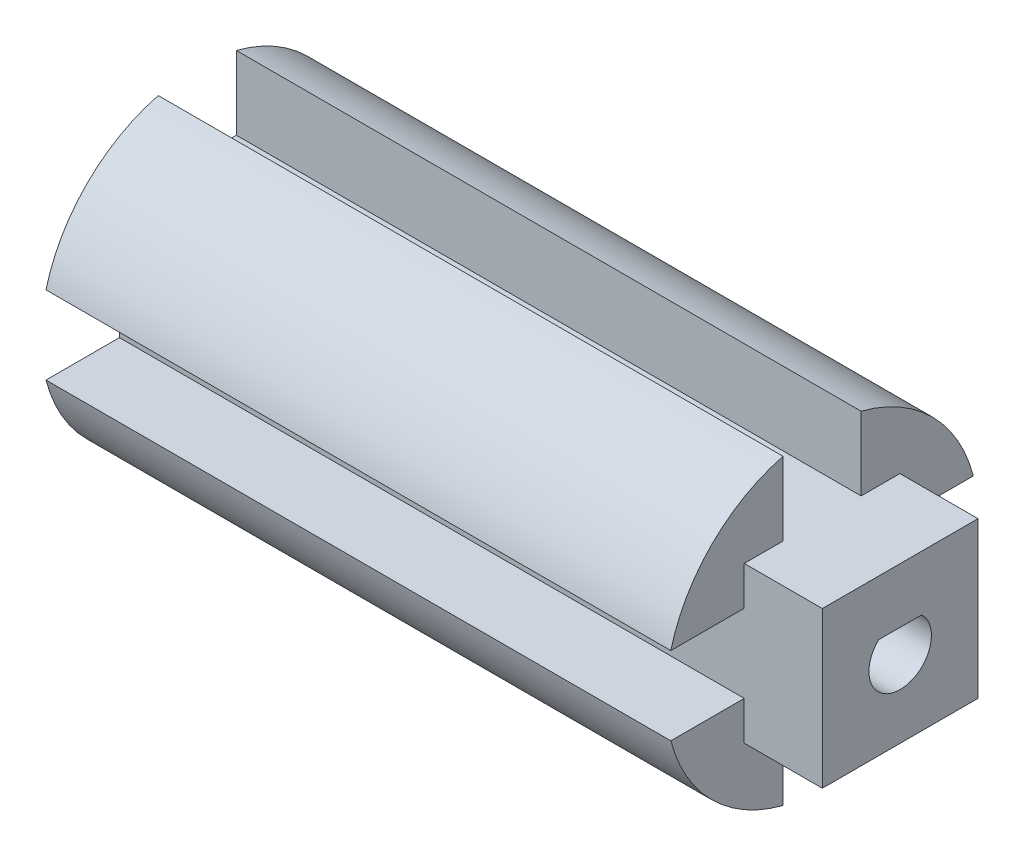
ISO-10303-21;
HEADER;
FILE_DESCRIPTION(('STEP AP214'),'2;1');
FILE_NAME('part.step','',(''),(''),'','','');
FILE_SCHEMA(('AUTOMOTIVE_DESIGN { 1 0 10303 214 1 1 1 1 }'));
ENDSEC;
DATA;
#1=APPLICATION_CONTEXT('core data for automotive mechanical design processes');
#2=APPLICATION_PROTOCOL_DEFINITION('international standard','automotive_design',2000,#1);
#3=PRODUCT_CONTEXT('',#1,'mechanical');
#4=PRODUCT('Part','Part','',(#3));
#5=PRODUCT_RELATED_PRODUCT_CATEGORY('part','',(#4));
#6=PRODUCT_DEFINITION_FORMATION('','',#4);
#7=PRODUCT_DEFINITION_CONTEXT('part definition',#1,'design');
#8=PRODUCT_DEFINITION('design','',#6,#7);
#9=PRODUCT_DEFINITION_SHAPE('','',#8);
#10=(LENGTH_UNIT() NAMED_UNIT(*) SI_UNIT(.MILLI.,.METRE.));
#11=(NAMED_UNIT(*) PLANE_ANGLE_UNIT() SI_UNIT($,.RADIAN.));
#12=(NAMED_UNIT(*) SI_UNIT($,.STERADIAN.) SOLID_ANGLE_UNIT());
#13=UNCERTAINTY_MEASURE_WITH_UNIT(LENGTH_MEASURE(1.E-05),#10,'distance_accuracy_value','');
#14=(GEOMETRIC_REPRESENTATION_CONTEXT(3) GLOBAL_UNCERTAINTY_ASSIGNED_CONTEXT((#13)) GLOBAL_UNIT_ASSIGNED_CONTEXT((#10,
#11,#12)) REPRESENTATION_CONTEXT('',''));
#15=CARTESIAN_POINT('',(0.,0.,0.));
#16=DIRECTION('',(0.,0.,1.));
#17=DIRECTION('',(1.,0.,0.));
#18=AXIS2_PLACEMENT_3D('',#15,#16,#17);
#19=CARTESIAN_POINT('',(90.,5.,0.));
#20=DIRECTION('',(0.,1.,0.));
#21=DIRECTION('',(0.,0.,1.));
#22=AXIS2_PLACEMENT_3D('',#19,#20,#21);
#23=PLANE('',#22);
#24=DIRECTION('',(0.,0.,-1.));
#25=VECTOR('',#24,1.);
#26=CARTESIAN_POINT('',(80.,5.,0.));
#27=LINE('',#26,#25);
#28=CARTESIAN_POINT('',(80.,5.,-9.96491673103709));
#29=VERTEX_POINT('',#28);
#30=CARTESIAN_POINT('',(80.,5.,-19.3649167310371));
#31=VERTEX_POINT('',#30);
#32=EDGE_CURVE('E201',#29,#31,#27,.T.);
#33=ORIENTED_EDGE('',*,*,#32,.F.);
#34=DIRECTION('',(-1.,0.,0.));
#35=VECTOR('',#34,1.);
#36=CARTESIAN_POINT('',(90.,5.,-9.96491673103709));
#37=LINE('',#36,#35);
#38=CARTESIAN_POINT('',(0.,5.,-9.96491673103709));
#39=VERTEX_POINT('',#38);
#40=EDGE_CURVE('E196',#29,#39,#37,.T.);
#41=ORIENTED_EDGE('',*,*,#40,.T.);
#42=DIRECTION('',(0.,0.,-1.));
#43=VECTOR('',#42,1.);
#44=CARTESIAN_POINT('',(0.,5.,0.));
#45=LINE('',#44,#43);
#46=CARTESIAN_POINT('',(0.,5.,-19.3649167310371));
#47=VERTEX_POINT('',#46);
#48=EDGE_CURVE('E304',#39,#47,#45,.T.);
#49=ORIENTED_EDGE('',*,*,#48,.T.);
#50=DIRECTION('',(-1.,0.,0.));
#51=VECTOR('',#50,1.);
#52=CARTESIAN_POINT('',(90.,5.,-19.3649167310371));
#53=LINE('',#52,#51);
#54=EDGE_CURVE('E11',#31,#47,#53,.T.);
#55=ORIENTED_EDGE('',*,*,#54,.F.);
#56=EDGE_LOOP('',(#33,#41,#49,#55));
#57=FACE_BOUND('',#56,.T.);
#58=ADVANCED_FACE('F42',(#57),#23,.F.);
#59=CARTESIAN_POINT('',(90.,0.,0.));
#60=DIRECTION('',(-1.,0.,0.));
#61=DIRECTION('',(0.,0.,1.));
#62=AXIS2_PLACEMENT_3D('',#59,#60,#61);
#63=CYLINDRICAL_SURFACE('',#62,20.);
#64=CARTESIAN_POINT('',(80.,0.,0.));
#65=DIRECTION('',(1.,0.,0.));
#66=DIRECTION('',(0.,0.,-1.));
#67=AXIS2_PLACEMENT_3D('',#64,#65,#66);
#68=CIRCLE('',#67,20.);
#69=CARTESIAN_POINT('',(80.,19.3649167310371,-5.));
#70=VERTEX_POINT('',#69);
#71=EDGE_CURVE('E227',#31,#70,#68,.T.);
#72=ORIENTED_EDGE('',*,*,#71,.F.);
#73=ORIENTED_EDGE('',*,*,#54,.T.);
#74=CARTESIAN_POINT('',(0.,0.,0.));
#75=DIRECTION('',(1.,0.,0.));
#76=DIRECTION('',(0.,0.,-1.));
#77=AXIS2_PLACEMENT_3D('',#74,#75,#76);
#78=CIRCLE('',#77,20.);
#79=CARTESIAN_POINT('',(0.,19.3649167310371,-5.));
#80=VERTEX_POINT('',#79);
#81=EDGE_CURVE('E321',#47,#80,#78,.T.);
#82=ORIENTED_EDGE('',*,*,#81,.T.);
#83=DIRECTION('',(-1.,0.,0.));
#84=VECTOR('',#83,1.);
#85=CARTESIAN_POINT('',(90.,19.3649167310371,-5.));
#86=LINE('',#85,#84);
#87=EDGE_CURVE('E50',#70,#80,#86,.T.);
#88=ORIENTED_EDGE('',*,*,#87,.F.);
#89=EDGE_LOOP('',(#72,#73,#82,#88));
#90=FACE_BOUND('',#89,.T.);
#91=ADVANCED_FACE('F419',(#90),#63,.T.);
#92=CARTESIAN_POINT('',(90.,0.,-5.));
#93=DIRECTION('',(0.,0.,1.));
#94=DIRECTION('',(0.,-1.,0.));
#95=AXIS2_PLACEMENT_3D('',#92,#93,#94);
#96=PLANE('',#95);
#97=DIRECTION('',(-1.,0.,0.));
#98=VECTOR('',#97,1.);
#99=CARTESIAN_POINT('',(90.,9.96491673103709,-5.));
#100=LINE('',#99,#98);
#101=CARTESIAN_POINT('',(80.,9.96491673103709,-5.));
#102=VERTEX_POINT('',#101);
#103=CARTESIAN_POINT('',(0.,9.96491673103709,-5.));
#104=VERTEX_POINT('',#103);
#105=EDGE_CURVE('E409',#102,#104,#100,.T.);
#106=ORIENTED_EDGE('',*,*,#105,.F.);
#107=DIRECTION('',(0.,-1.,0.));
#108=VECTOR('',#107,1.);
#109=CARTESIAN_POINT('',(80.,0.,-5.));
#110=LINE('',#109,#108);
#111=EDGE_CURVE('E213',#70,#102,#110,.T.);
#112=ORIENTED_EDGE('',*,*,#111,.F.);
#113=ORIENTED_EDGE('',*,*,#87,.T.);
#114=DIRECTION('',(0.,1.,0.));
#115=VECTOR('',#114,1.);
#116=CARTESIAN_POINT('',(0.,0.,-5.));
#117=LINE('',#116,#115);
#118=EDGE_CURVE('E325',#104,#80,#117,.T.);
#119=ORIENTED_EDGE('',*,*,#118,.F.);
#120=EDGE_LOOP('',(#106,#112,#113,#119));
#121=FACE_BOUND('',#120,.T.);
#122=ADVANCED_FACE('F415',(#121),#96,.T.);
#123=CARTESIAN_POINT('',(90.,0.,5.));
#124=DIRECTION('',(0.,0.,1.));
#125=DIRECTION('',(0.,-1.,0.));
#126=AXIS2_PLACEMENT_3D('',#123,#124,#125);
#127=PLANE('',#126);
#128=DIRECTION('',(0.,1.,0.));
#129=VECTOR('',#128,1.);
#130=CARTESIAN_POINT('',(80.,0.,5.));
#131=LINE('',#130,#129);
#132=CARTESIAN_POINT('',(80.,9.96491673103709,5.));
#133=VERTEX_POINT('',#132);
#134=CARTESIAN_POINT('',(80.,19.3649167310371,5.));
#135=VERTEX_POINT('',#134);
#136=EDGE_CURVE('E272',#133,#135,#131,.T.);
#137=ORIENTED_EDGE('',*,*,#136,.F.);
#138=DIRECTION('',(-1.,0.,0.));
#139=VECTOR('',#138,1.);
#140=CARTESIAN_POINT('',(90.,9.96491673103709,5.));
#141=LINE('',#140,#139);
#142=CARTESIAN_POINT('',(0.,9.96491673103709,5.));
#143=VERTEX_POINT('',#142);
#144=EDGE_CURVE('E406',#133,#143,#141,.T.);
#145=ORIENTED_EDGE('',*,*,#144,.T.);
#146=DIRECTION('',(0.,1.,0.));
#147=VECTOR('',#146,1.);
#148=CARTESIAN_POINT('',(0.,0.,5.));
#149=LINE('',#148,#147);
#150=CARTESIAN_POINT('',(0.,19.3649167310371,5.));
#151=VERTEX_POINT('',#150);
#152=EDGE_CURVE('E335',#143,#151,#149,.T.);
#153=ORIENTED_EDGE('',*,*,#152,.T.);
#154=DIRECTION('',(-1.,0.,0.));
#155=VECTOR('',#154,1.);
#156=CARTESIAN_POINT('',(90.,19.3649167310371,5.));
#157=LINE('',#156,#155);
#158=EDGE_CURVE('E403',#135,#151,#157,.T.);
#159=ORIENTED_EDGE('',*,*,#158,.F.);
#160=EDGE_LOOP('',(#137,#145,#153,#159));
#161=FACE_BOUND('',#160,.T.);
#162=ADVANCED_FACE('F430',(#161),#127,.F.);
#163=CARTESIAN_POINT('',(80.,0.,0.));
#164=DIRECTION('',(1.,0.,0.));
#165=DIRECTION('',(0.,0.,-1.));
#166=AXIS2_PLACEMENT_3D('',#163,#164,#165);
#167=CIRCLE('',#166,20.);
#168=CARTESIAN_POINT('',(80.,5.,19.3649167310371));
#169=VERTEX_POINT('',#168);
#170=EDGE_CURVE('E275',#135,#169,#167,.T.);
#171=ORIENTED_EDGE('',*,*,#170,.F.);
#172=ORIENTED_EDGE('',*,*,#158,.T.);
#173=CARTESIAN_POINT('',(0.,5.,19.3649167310371));
#174=VERTEX_POINT('',#173);
#175=EDGE_CURVE('E327',#151,#174,#78,.T.);
#176=ORIENTED_EDGE('',*,*,#175,.T.);
#177=DIRECTION('',(-1.,0.,0.));
#178=VECTOR('',#177,1.);
#179=CARTESIAN_POINT('',(90.,5.,19.3649167310371));
#180=LINE('',#179,#178);
#181=EDGE_CURVE('E400',#169,#174,#180,.T.);
#182=ORIENTED_EDGE('',*,*,#181,.F.);
#183=EDGE_LOOP('',(#171,#172,#176,#182));
#184=FACE_BOUND('',#183,.T.);
#185=ADVANCED_FACE('F439',(#184),#63,.T.);
#186=CARTESIAN_POINT('',(90.,5.,0.));
#187=DIRECTION('',(0.,1.,0.));
#188=DIRECTION('',(0.,0.,1.));
#189=AXIS2_PLACEMENT_3D('',#186,#187,#188);
#190=PLANE('',#189);
#191=DIRECTION('',(0.,0.,-1.));
#192=VECTOR('',#191,1.);
#193=CARTESIAN_POINT('',(80.,5.,0.));
#194=LINE('',#193,#192);
#195=CARTESIAN_POINT('',(80.,5.,9.96491673103709));
#196=VERTEX_POINT('',#195);
#197=EDGE_CURVE('E278',#169,#196,#194,.T.);
#198=ORIENTED_EDGE('',*,*,#197,.F.);
#199=ORIENTED_EDGE('',*,*,#181,.T.);
#200=DIRECTION('',(0.,0.,-1.));
#201=VECTOR('',#200,1.);
#202=CARTESIAN_POINT('',(0.,5.,0.));
#203=LINE('',#202,#201);
#204=CARTESIAN_POINT('',(0.,5.,9.96491673103709));
#205=VERTEX_POINT('',#204);
#206=EDGE_CURVE('E339',#174,#205,#203,.T.);
#207=ORIENTED_EDGE('',*,*,#206,.T.);
#208=DIRECTION('',(-1.,0.,0.));
#209=VECTOR('',#208,1.);
#210=CARTESIAN_POINT('',(90.,5.,9.96491673103709));
#211=LINE('',#210,#209);
#212=EDGE_CURVE('E397',#196,#205,#211,.T.);
#213=ORIENTED_EDGE('',*,*,#212,.F.);
#214=EDGE_LOOP('',(#198,#199,#207,#213));
#215=FACE_BOUND('',#214,.T.);
#216=ADVANCED_FACE('F443',(#215),#190,.F.);
#217=CARTESIAN_POINT('',(90.,-5.,0.));
#218=DIRECTION('',(0.,1.,0.));
#219=DIRECTION('',(0.,0.,1.));
#220=AXIS2_PLACEMENT_3D('',#217,#218,#219);
#221=PLANE('',#220);
#222=DIRECTION('',(-1.,0.,0.));
#223=VECTOR('',#222,1.);
#224=CARTESIAN_POINT('',(90.,-5.,19.3649167310371));
#225=LINE('',#224,#223);
#226=CARTESIAN_POINT('',(80.,-4.99999999999999,19.3649167310371));
#227=VERTEX_POINT('',#226);
#228=CARTESIAN_POINT('',(0.,-5.,19.3649167310371));
#229=VERTEX_POINT('',#228);
#230=EDGE_CURVE('E391',#227,#229,#225,.T.);
#231=ORIENTED_EDGE('',*,*,#230,.F.);
#232=DIRECTION('',(0.,0.,1.));
#233=VECTOR('',#232,1.);
#234=CARTESIAN_POINT('',(80.,-5.,0.));
#235=LINE('',#234,#233);
#236=CARTESIAN_POINT('',(80.,-5.,9.96491673103709));
#237=VERTEX_POINT('',#236);
#238=EDGE_CURVE('E254',#237,#227,#235,.T.);
#239=ORIENTED_EDGE('',*,*,#238,.F.);
#240=DIRECTION('',(-1.,0.,0.));
#241=VECTOR('',#240,1.);
#242=CARTESIAN_POINT('',(90.,-5.,9.96491673103709));
#243=LINE('',#242,#241);
#244=CARTESIAN_POINT('',(0.,-5.,9.96491673103709));
#245=VERTEX_POINT('',#244);
#246=EDGE_CURVE('E394',#237,#245,#243,.T.);
#247=ORIENTED_EDGE('',*,*,#246,.T.);
#248=DIRECTION('',(0.,0.,-1.));
#249=VECTOR('',#248,1.);
#250=CARTESIAN_POINT('',(0.,-5.,0.));
#251=LINE('',#250,#249);
#252=EDGE_CURVE('E347',#229,#245,#251,.T.);
#253=ORIENTED_EDGE('',*,*,#252,.F.);
#254=EDGE_LOOP('',(#231,#239,#247,#253));
#255=FACE_BOUND('',#254,.T.);
#256=ADVANCED_FACE('F488',(#255),#221,.T.);
#257=CARTESIAN_POINT('',(80.,0.,0.));
#258=DIRECTION('',(1.,0.,0.));
#259=DIRECTION('',(0.,0.,-1.));
#260=AXIS2_PLACEMENT_3D('',#257,#258,#259);
#261=CIRCLE('',#260,20.);
#262=CARTESIAN_POINT('',(80.,-19.3649167310371,5.));
#263=VERTEX_POINT('',#262);
#264=EDGE_CURVE('E257',#227,#263,#261,.T.);
#265=ORIENTED_EDGE('',*,*,#264,.F.);
#266=ORIENTED_EDGE('',*,*,#230,.T.);
#267=CARTESIAN_POINT('',(0.,-19.3649167310371,5.));
#268=VERTEX_POINT('',#267);
#269=EDGE_CURVE('E351',#229,#268,#78,.T.);
#270=ORIENTED_EDGE('',*,*,#269,.T.);
#271=DIRECTION('',(-1.,0.,0.));
#272=VECTOR('',#271,1.);
#273=CARTESIAN_POINT('',(90.,-19.3649167310371,5.));
#274=LINE('',#273,#272);
#275=EDGE_CURVE('E388',#263,#268,#274,.T.);
#276=ORIENTED_EDGE('',*,*,#275,.F.);
#277=EDGE_LOOP('',(#265,#266,#270,#276));
#278=FACE_BOUND('',#277,.T.);
#279=ADVANCED_FACE('F477',(#278),#63,.T.);
#280=CARTESIAN_POINT('',(90.,0.,5.));
#281=DIRECTION('',(0.,0.,1.));
#282=DIRECTION('',(0.,-1.,0.));
#283=AXIS2_PLACEMENT_3D('',#280,#281,#282);
#284=PLANE('',#283);
#285=DIRECTION('',(0.,1.,0.));
#286=VECTOR('',#285,1.);
#287=CARTESIAN_POINT('',(80.,0.,5.));
#288=LINE('',#287,#286);
#289=CARTESIAN_POINT('',(80.,-9.96491673103708,5.));
#290=VERTEX_POINT('',#289);
#291=EDGE_CURVE('E260',#263,#290,#288,.T.);
#292=ORIENTED_EDGE('',*,*,#291,.F.);
#293=ORIENTED_EDGE('',*,*,#275,.T.);
#294=DIRECTION('',(0.,1.,0.));
#295=VECTOR('',#294,1.);
#296=CARTESIAN_POINT('',(0.,0.,5.));
#297=LINE('',#296,#295);
#298=CARTESIAN_POINT('',(0.,-9.96491673103708,5.));
#299=VERTEX_POINT('',#298);
#300=EDGE_CURVE('E352',#268,#299,#297,.T.);
#301=ORIENTED_EDGE('',*,*,#300,.T.);
#302=DIRECTION('',(-1.,0.,0.));
#303=VECTOR('',#302,1.);
#304=CARTESIAN_POINT('',(90.,-9.96491673103708,5.));
#305=LINE('',#304,#303);
#306=EDGE_CURVE('E385',#290,#299,#305,.T.);
#307=ORIENTED_EDGE('',*,*,#306,.F.);
#308=EDGE_LOOP('',(#292,#293,#301,#307));
#309=FACE_BOUND('',#308,.T.);
#310=ADVANCED_FACE('F485',(#309),#284,.F.);
#311=CARTESIAN_POINT('',(90.,0.,-5.));
#312=DIRECTION('',(0.,0.,1.));
#313=DIRECTION('',(0.,-1.,0.));
#314=AXIS2_PLACEMENT_3D('',#311,#312,#313);
#315=PLANE('',#314);
#316=DIRECTION('',(-1.,0.,0.));
#317=VECTOR('',#316,1.);
#318=CARTESIAN_POINT('',(90.,-19.3649167310371,-5.));
#319=LINE('',#318,#317);
#320=CARTESIAN_POINT('',(80.,-19.3649167310371,-5.));
#321=VERTEX_POINT('',#320);
#322=CARTESIAN_POINT('',(0.,-19.3649167310371,-5.));
#323=VERTEX_POINT('',#322);
#324=EDGE_CURVE('E379',#321,#323,#319,.T.);
#325=ORIENTED_EDGE('',*,*,#324,.F.);
#326=DIRECTION('',(0.,-1.,0.));
#327=VECTOR('',#326,1.);
#328=CARTESIAN_POINT('',(80.,0.,-5.));
#329=LINE('',#328,#327);
#330=CARTESIAN_POINT('',(80.,-9.96491673103708,-5.));
#331=VERTEX_POINT('',#330);
#332=EDGE_CURVE('E239',#331,#321,#329,.T.);
#333=ORIENTED_EDGE('',*,*,#332,.F.);
#334=DIRECTION('',(-1.,0.,0.));
#335=VECTOR('',#334,1.);
#336=CARTESIAN_POINT('',(90.,-9.96491673103708,-5.));
#337=LINE('',#336,#335);
#338=CARTESIAN_POINT('',(0.,-9.96491673103708,-5.));
#339=VERTEX_POINT('',#338);
#340=EDGE_CURVE('E382',#331,#339,#337,.T.);
#341=ORIENTED_EDGE('',*,*,#340,.T.);
#342=DIRECTION('',(0.,1.,0.));
#343=VECTOR('',#342,1.);
#344=CARTESIAN_POINT('',(0.,0.,-5.));
#345=LINE('',#344,#343);
#346=EDGE_CURVE('E360',#323,#339,#345,.T.);
#347=ORIENTED_EDGE('',*,*,#346,.F.);
#348=EDGE_LOOP('',(#325,#333,#341,#347));
#349=FACE_BOUND('',#348,.T.);
#350=ADVANCED_FACE('F479',(#349),#315,.T.);
#351=CARTESIAN_POINT('',(80.,0.,0.));
#352=DIRECTION('',(1.,0.,0.));
#353=DIRECTION('',(0.,0.,-1.));
#354=AXIS2_PLACEMENT_3D('',#351,#352,#353);
#355=CIRCLE('',#354,20.);
#356=CARTESIAN_POINT('',(80.,-5.,-19.3649167310371));
#357=VERTEX_POINT('',#356);
#358=EDGE_CURVE('E242',#321,#357,#355,.T.);
#359=ORIENTED_EDGE('',*,*,#358,.F.);
#360=ORIENTED_EDGE('',*,*,#324,.T.);
#361=CARTESIAN_POINT('',(0.,-5.,-19.3649167310371));
#362=VERTEX_POINT('',#361);
#363=EDGE_CURVE('E326',#323,#362,#78,.T.);
#364=ORIENTED_EDGE('',*,*,#363,.T.);
#365=DIRECTION('',(-1.,0.,0.));
#366=VECTOR('',#365,1.);
#367=CARTESIAN_POINT('',(90.,-5.,-19.3649167310371));
#368=LINE('',#367,#366);
#369=EDGE_CURVE('E376',#357,#362,#368,.T.);
#370=ORIENTED_EDGE('',*,*,#369,.F.);
#371=EDGE_LOOP('',(#359,#360,#364,#370));
#372=FACE_BOUND('',#371,.T.);
#373=ADVANCED_FACE('F470',(#372),#63,.T.);
#374=CARTESIAN_POINT('',(90.,-5.,0.));
#375=DIRECTION('',(0.,1.,0.));
#376=DIRECTION('',(0.,0.,1.));
#377=AXIS2_PLACEMENT_3D('',#374,#375,#376);
#378=PLANE('',#377);
#379=DIRECTION('',(-1.,0.,0.));
#380=VECTOR('',#379,1.);
#381=CARTESIAN_POINT('',(90.,-5.,-9.96491673103709));
#382=LINE('',#381,#380);
#383=CARTESIAN_POINT('',(80.,-5.,-9.96491673103709));
#384=VERTEX_POINT('',#383);
#385=CARTESIAN_POINT('',(0.,-5.,-9.96491673103709));
#386=VERTEX_POINT('',#385);
#387=EDGE_CURVE('E373',#384,#386,#382,.T.);
#388=ORIENTED_EDGE('',*,*,#387,.F.);
#389=DIRECTION('',(0.,0.,1.));
#390=VECTOR('',#389,1.);
#391=CARTESIAN_POINT('',(80.,-5.,0.));
#392=LINE('',#391,#390);
#393=EDGE_CURVE('E222',#357,#384,#392,.T.);
#394=ORIENTED_EDGE('',*,*,#393,.F.);
#395=ORIENTED_EDGE('',*,*,#369,.T.);
#396=DIRECTION('',(0.,0.,-1.));
#397=VECTOR('',#396,1.);
#398=CARTESIAN_POINT('',(0.,-5.,0.));
#399=LINE('',#398,#397);
#400=EDGE_CURVE('E364',#386,#362,#399,.T.);
#401=ORIENTED_EDGE('',*,*,#400,.F.);
#402=EDGE_LOOP('',(#388,#394,#395,#401));
#403=FACE_BOUND('',#402,.T.);
#404=ADVANCED_FACE('F462',(#403),#378,.T.);
#405=CARTESIAN_POINT('',(90.,0.,0.));
#406=DIRECTION('',(1.,0.,0.));
#407=DIRECTION('',(0.,0.,-1.));
#408=AXIS2_PLACEMENT_3D('',#405,#406,#407);
#409=PLANE('',#408);
#410=CARTESIAN_POINT('',(90.,0.,0.));
#411=DIRECTION('',(1.,0.,0.));
#412=DIRECTION('',(0.,0.,-1.));
#413=AXIS2_PLACEMENT_3D('',#410,#411,#412);
#414=CIRCLE('',#413,4.);
#415=CARTESIAN_POINT('',(90.,2.9,2.75499546279118));
#416=VERTEX_POINT('',#415);
#417=CARTESIAN_POINT('',(90.,2.9,-2.75499546279118));
#418=VERTEX_POINT('',#417);
#419=EDGE_CURVE('E285',#416,#418,#414,.T.);
#420=ORIENTED_EDGE('',*,*,#419,.F.);
#421=DIRECTION('',(0.,0.,1.));
#422=VECTOR('',#421,1.);
#423=CARTESIAN_POINT('',(90.,2.9,2.75499546279118));
#424=LINE('',#423,#422);
#425=EDGE_CURVE('E291',#418,#416,#424,.T.);
#426=ORIENTED_EDGE('',*,*,#425,.F.);
#427=EDGE_LOOP('',(#420,#426));
#428=FACE_BOUND('',#427,.T.);
#429=DIRECTION('',(0.,-1.,0.));
#430=VECTOR('',#429,1.);
#431=CARTESIAN_POINT('',(90.,0.,9.96491673103709));
#432=LINE('',#431,#430);
#433=CARTESIAN_POINT('',(90.,9.96491673103709,9.96491673103709));
#434=VERTEX_POINT('',#433);
#435=CARTESIAN_POINT('',(90.,-9.96491673103708,9.96491673103709));
#436=VERTEX_POINT('',#435);
#437=EDGE_CURVE('E310',#434,#436,#432,.T.);
#438=ORIENTED_EDGE('',*,*,#437,.T.);
#439=DIRECTION('',(0.,0.,-1.));
#440=VECTOR('',#439,1.);
#441=CARTESIAN_POINT('',(90.,-9.96491673103708,0.));
#442=LINE('',#441,#440);
#443=CARTESIAN_POINT('',(90.,-9.96491673103708,-9.96491673103709));
#444=VERTEX_POINT('',#443);
#445=EDGE_CURVE('E57',#436,#444,#442,.T.);
#446=ORIENTED_EDGE('',*,*,#445,.T.);
#447=DIRECTION('',(0.,-1.,0.));
#448=VECTOR('',#447,1.);
#449=CARTESIAN_POINT('',(90.,0.,-9.96491673103709));
#450=LINE('',#449,#448);
#451=CARTESIAN_POINT('',(90.,9.96491673103709,-9.96491673103709));
#452=VERTEX_POINT('',#451);
#453=EDGE_CURVE('E65',#452,#444,#450,.T.);
#454=ORIENTED_EDGE('',*,*,#453,.F.);
#455=DIRECTION('',(0.,0.,-1.));
#456=VECTOR('',#455,1.);
#457=CARTESIAN_POINT('',(90.,9.96491673103709,0.));
#458=LINE('',#457,#456);
#459=EDGE_CURVE('E210',#434,#452,#458,.T.);
#460=ORIENTED_EDGE('',*,*,#459,.F.);
#461=EDGE_LOOP('',(#438,#446,#454,#460));
#462=FACE_BOUND('',#461,.T.);
#463=ADVANCED_FACE('F449',(#428,#462),#409,.T.);
#464=CARTESIAN_POINT('',(90.,9.96491673103709,0.));
#465=DIRECTION('',(0.,1.,0.));
#466=DIRECTION('',(0.,0.,1.));
#467=AXIS2_PLACEMENT_3D('',#464,#465,#466);
#468=PLANE('',#467);
#469=DIRECTION('',(0.,0.,-1.));
#470=VECTOR('',#469,1.);
#471=CARTESIAN_POINT('',(0.,9.96491673103709,0.));
#472=LINE('',#471,#470);
#473=EDGE_CURVE('E331',#143,#104,#472,.T.);
#474=ORIENTED_EDGE('',*,*,#473,.F.);
#475=ORIENTED_EDGE('',*,*,#144,.F.);
#476=DIRECTION('',(0.,0.,1.));
#477=VECTOR('',#476,1.);
#478=CARTESIAN_POINT('',(80.,9.96491673103709,0.));
#479=LINE('',#478,#477);
#480=CARTESIAN_POINT('',(80.,9.96491673103709,9.96491673103709));
#481=VERTEX_POINT('',#480);
#482=EDGE_CURVE('E269',#133,#481,#479,.T.);
#483=ORIENTED_EDGE('',*,*,#482,.T.);
#484=DIRECTION('',(1.,0.,0.));
#485=VECTOR('',#484,1.);
#486=CARTESIAN_POINT('',(80.,9.96491673103709,9.96491673103709));
#487=LINE('',#486,#485);
#488=EDGE_CURVE('E282',#481,#434,#487,.T.);
#489=ORIENTED_EDGE('',*,*,#488,.T.);
#490=ORIENTED_EDGE('',*,*,#459,.T.);
#491=DIRECTION('',(1.,0.,0.));
#492=VECTOR('',#491,1.);
#493=CARTESIAN_POINT('',(80.,9.96491673103709,-9.96491673103709));
#494=LINE('',#493,#492);
#495=CARTESIAN_POINT('',(80.,9.96491673103709,-9.96491673103709));
#496=VERTEX_POINT('',#495);
#497=EDGE_CURVE('E195',#496,#452,#494,.T.);
#498=ORIENTED_EDGE('',*,*,#497,.F.);
#499=DIRECTION('',(0.,0.,1.));
#500=VECTOR('',#499,1.);
#501=CARTESIAN_POINT('',(80.,9.96491673103709,0.));
#502=LINE('',#501,#500);
#503=EDGE_CURVE('E202',#496,#102,#502,.T.);
#504=ORIENTED_EDGE('',*,*,#503,.T.);
#505=ORIENTED_EDGE('',*,*,#105,.T.);
#506=EDGE_LOOP('',(#474,#475,#483,#489,#490,#498,#504,#505));
#507=FACE_BOUND('',#506,.T.);
#508=ADVANCED_FACE('F206',(#507),#468,.T.);
#509=CARTESIAN_POINT('',(90.,0.,9.96491673103709));
#510=DIRECTION('',(0.,0.,-1.));
#511=DIRECTION('',(-1.,0.,0.));
#512=AXIS2_PLACEMENT_3D('',#509,#510,#511);
#513=PLANE('',#512);
#514=DIRECTION('',(0.,-1.,0.));
#515=VECTOR('',#514,1.);
#516=CARTESIAN_POINT('',(0.,0.,9.96491673103709));
#517=LINE('',#516,#515);
#518=EDGE_CURVE('E343',#205,#245,#517,.T.);
#519=ORIENTED_EDGE('',*,*,#518,.T.);
#520=ORIENTED_EDGE('',*,*,#246,.F.);
#521=DIRECTION('',(0.,-1.,0.));
#522=VECTOR('',#521,1.);
#523=CARTESIAN_POINT('',(80.,0.,9.96491673103709));
#524=LINE('',#523,#522);
#525=CARTESIAN_POINT('',(80.,-9.96491673103708,9.96491673103709));
#526=VERTEX_POINT('',#525);
#527=EDGE_CURVE('E251',#237,#526,#524,.T.);
#528=ORIENTED_EDGE('',*,*,#527,.T.);
#529=DIRECTION('',(1.,0.,0.));
#530=VECTOR('',#529,1.);
#531=CARTESIAN_POINT('',(80.,-9.96491673103708,9.96491673103709));
#532=LINE('',#531,#530);
#533=EDGE_CURVE('E236',#526,#436,#532,.T.);
#534=ORIENTED_EDGE('',*,*,#533,.T.);
#535=ORIENTED_EDGE('',*,*,#437,.F.);
#536=ORIENTED_EDGE('',*,*,#488,.F.);
#537=DIRECTION('',(0.,-1.,0.));
#538=VECTOR('',#537,1.);
#539=CARTESIAN_POINT('',(80.,0.,9.96491673103709));
#540=LINE('',#539,#538);
#541=EDGE_CURVE('E212',#481,#196,#540,.T.);
#542=ORIENTED_EDGE('',*,*,#541,.T.);
#543=ORIENTED_EDGE('',*,*,#212,.T.);
#544=EDGE_LOOP('',(#519,#520,#528,#534,#535,#536,#542,#543));
#545=FACE_BOUND('',#544,.T.);
#546=ADVANCED_FACE('F447',(#545),#513,.F.);
#547=CARTESIAN_POINT('',(90.,-9.96491673103708,0.));
#548=DIRECTION('',(0.,1.,0.));
#549=DIRECTION('',(0.,0.,1.));
#550=AXIS2_PLACEMENT_3D('',#547,#548,#549);
#551=PLANE('',#550);
#552=DIRECTION('',(0.,0.,-1.));
#553=VECTOR('',#552,1.);
#554=CARTESIAN_POINT('',(0.,-9.96491673103708,0.));
#555=LINE('',#554,#553);
#556=EDGE_CURVE('E356',#299,#339,#555,.T.);
#557=ORIENTED_EDGE('',*,*,#556,.T.);
#558=ORIENTED_EDGE('',*,*,#340,.F.);
#559=DIRECTION('',(0.,0.,-1.));
#560=VECTOR('',#559,1.);
#561=CARTESIAN_POINT('',(80.,-9.96491673103708,0.));
#562=LINE('',#561,#560);
#563=CARTESIAN_POINT('',(80.,-9.96491673103708,-9.96491673103709));
#564=VERTEX_POINT('',#563);
#565=EDGE_CURVE('E235',#331,#564,#562,.T.);
#566=ORIENTED_EDGE('',*,*,#565,.T.);
#567=DIRECTION('',(1.,0.,0.));
#568=VECTOR('',#567,1.);
#569=CARTESIAN_POINT('',(80.,-9.96491673103708,-9.96491673103709));
#570=LINE('',#569,#568);
#571=EDGE_CURVE('E219',#564,#444,#570,.T.);
#572=ORIENTED_EDGE('',*,*,#571,.T.);
#573=ORIENTED_EDGE('',*,*,#445,.F.);
#574=ORIENTED_EDGE('',*,*,#533,.F.);
#575=DIRECTION('',(0.,0.,-1.));
#576=VECTOR('',#575,1.);
#577=CARTESIAN_POINT('',(80.,-9.96491673103708,0.));
#578=LINE('',#577,#576);
#579=EDGE_CURVE('E248',#526,#290,#578,.T.);
#580=ORIENTED_EDGE('',*,*,#579,.T.);
#581=ORIENTED_EDGE('',*,*,#306,.T.);
#582=EDGE_LOOP('',(#557,#558,#566,#572,#573,#574,#580,#581));
#583=FACE_BOUND('',#582,.T.);
#584=ADVANCED_FACE('F450',(#583),#551,.F.);
#585=CARTESIAN_POINT('',(90.,0.,-9.96491673103709));
#586=DIRECTION('',(0.,0.,-1.));
#587=DIRECTION('',(0.,1.,0.));
#588=AXIS2_PLACEMENT_3D('',#585,#586,#587);
#589=PLANE('',#588);
#590=DIRECTION('',(0.,-1.,0.));
#591=VECTOR('',#590,1.);
#592=CARTESIAN_POINT('',(0.,0.,-9.96491673103709));
#593=LINE('',#592,#591);
#594=EDGE_CURVE('E311',#39,#386,#593,.T.);
#595=ORIENTED_EDGE('',*,*,#594,.F.);
#596=ORIENTED_EDGE('',*,*,#40,.F.);
#597=DIRECTION('',(0.,1.,0.));
#598=VECTOR('',#597,1.);
#599=CARTESIAN_POINT('',(80.,0.,-9.96491673103709));
#600=LINE('',#599,#598);
#601=EDGE_CURVE('E191',#29,#496,#600,.T.);
#602=ORIENTED_EDGE('',*,*,#601,.T.);
#603=ORIENTED_EDGE('',*,*,#497,.T.);
#604=ORIENTED_EDGE('',*,*,#453,.T.);
#605=ORIENTED_EDGE('',*,*,#571,.F.);
#606=DIRECTION('',(0.,1.,0.));
#607=VECTOR('',#606,1.);
#608=CARTESIAN_POINT('',(80.,0.,-9.96491673103709));
#609=LINE('',#608,#607);
#610=EDGE_CURVE('E232',#564,#384,#609,.T.);
#611=ORIENTED_EDGE('',*,*,#610,.T.);
#612=ORIENTED_EDGE('',*,*,#387,.T.);
#613=EDGE_LOOP('',(#595,#596,#602,#603,#604,#605,#611,#612));
#614=FACE_BOUND('',#613,.T.);
#615=ADVANCED_FACE('F194',(#614),#589,.T.);
#616=CARTESIAN_POINT('',(0.,0.,0.));
#617=DIRECTION('',(1.,0.,0.));
#618=DIRECTION('',(0.,0.,-1.));
#619=AXIS2_PLACEMENT_3D('',#616,#617,#618);
#620=PLANE('',#619);
#621=ORIENTED_EDGE('',*,*,#48,.F.);
#622=ORIENTED_EDGE('',*,*,#594,.T.);
#623=ORIENTED_EDGE('',*,*,#400,.T.);
#624=ORIENTED_EDGE('',*,*,#363,.F.);
#625=ORIENTED_EDGE('',*,*,#346,.T.);
#626=ORIENTED_EDGE('',*,*,#556,.F.);
#627=ORIENTED_EDGE('',*,*,#300,.F.);
#628=ORIENTED_EDGE('',*,*,#269,.F.);
#629=ORIENTED_EDGE('',*,*,#252,.T.);
#630=ORIENTED_EDGE('',*,*,#518,.F.);
#631=ORIENTED_EDGE('',*,*,#206,.F.);
#632=ORIENTED_EDGE('',*,*,#175,.F.);
#633=ORIENTED_EDGE('',*,*,#152,.F.);
#634=ORIENTED_EDGE('',*,*,#473,.T.);
#635=ORIENTED_EDGE('',*,*,#118,.T.);
#636=ORIENTED_EDGE('',*,*,#81,.F.);
#637=EDGE_LOOP('',(#621,#622,#623,#624,#625,#626,#627,#628,#629,#630,#631,#632,#633,#634,#635,#636));
#638=FACE_BOUND('',#637,.T.);
#639=ADVANCED_FACE('F423',(#638),#620,.F.);
#640=CARTESIAN_POINT('',(72.,0.,0.));
#641=DIRECTION('',(1.,0.,0.));
#642=DIRECTION('',(0.,0.,-1.));
#643=AXIS2_PLACEMENT_3D('',#640,#641,#642);
#644=CYLINDRICAL_SURFACE('',#643,4.);
#645=ORIENTED_EDGE('',*,*,#419,.T.);
#646=DIRECTION('',(1.,0.,0.));
#647=VECTOR('',#646,1.);
#648=CARTESIAN_POINT('',(72.,2.9,-2.75499546279118));
#649=LINE('',#648,#647);
#650=CARTESIAN_POINT('',(72.,2.9,-2.75499546279118));
#651=VERTEX_POINT('',#650);
#652=EDGE_CURVE('E295',#651,#418,#649,.T.);
#653=ORIENTED_EDGE('',*,*,#652,.F.);
#654=CARTESIAN_POINT('',(72.,0.,0.));
#655=DIRECTION('',(1.,0.,0.));
#656=DIRECTION('',(0.,0.,-1.));
#657=AXIS2_PLACEMENT_3D('',#654,#655,#656);
#658=CIRCLE('',#657,4.);
#659=CARTESIAN_POINT('',(72.,2.9,2.75499546279118));
#660=VERTEX_POINT('',#659);
#661=EDGE_CURVE('E286',#660,#651,#658,.T.);
#662=ORIENTED_EDGE('',*,*,#661,.F.);
#663=DIRECTION('',(1.,0.,0.));
#664=VECTOR('',#663,1.);
#665=CARTESIAN_POINT('',(72.,2.9,2.75499546279118));
#666=LINE('',#665,#664);
#667=EDGE_CURVE('E301',#660,#416,#666,.T.);
#668=ORIENTED_EDGE('',*,*,#667,.T.);
#669=EDGE_LOOP('',(#645,#653,#662,#668));
#670=FACE_BOUND('',#669,.T.);
#671=ADVANCED_FACE('F536',(#670),#644,.F.);
#672=CARTESIAN_POINT('',(72.,2.9,2.75499546279118));
#673=DIRECTION('',(0.,1.,0.));
#674=DIRECTION('',(0.,0.,1.));
#675=AXIS2_PLACEMENT_3D('',#672,#673,#674);
#676=PLANE('',#675);
#677=ORIENTED_EDGE('',*,*,#425,.T.);
#678=ORIENTED_EDGE('',*,*,#667,.F.);
#679=DIRECTION('',(0.,0.,1.));
#680=VECTOR('',#679,1.);
#681=CARTESIAN_POINT('',(72.,2.9,2.75499546279118));
#682=LINE('',#681,#680);
#683=EDGE_CURVE('E290',#651,#660,#682,.T.);
#684=ORIENTED_EDGE('',*,*,#683,.F.);
#685=ORIENTED_EDGE('',*,*,#652,.T.);
#686=EDGE_LOOP('',(#677,#678,#684,#685));
#687=FACE_BOUND('',#686,.T.);
#688=ADVANCED_FACE('F532',(#687),#676,.F.);
#689=CARTESIAN_POINT('',(72.,0.,0.));
#690=DIRECTION('',(1.,0.,0.));
#691=DIRECTION('',(0.,0.,-1.));
#692=AXIS2_PLACEMENT_3D('',#689,#690,#691);
#693=PLANE('',#692);
#694=ORIENTED_EDGE('',*,*,#661,.T.);
#695=ORIENTED_EDGE('',*,*,#683,.T.);
#696=EDGE_LOOP('',(#694,#695));
#697=FACE_BOUND('',#696,.T.);
#698=ADVANCED_FACE('F529',(#697),#693,.T.);
#699=CARTESIAN_POINT('',(80.,0.,0.));
#700=DIRECTION('',(1.,0.,0.));
#701=DIRECTION('',(0.,0.,-1.));
#702=AXIS2_PLACEMENT_3D('',#699,#700,#701);
#703=PLANE('',#702);
#704=ORIENTED_EDGE('',*,*,#541,.F.);
#705=ORIENTED_EDGE('',*,*,#482,.F.);
#706=ORIENTED_EDGE('',*,*,#136,.T.);
#707=ORIENTED_EDGE('',*,*,#170,.T.);
#708=ORIENTED_EDGE('',*,*,#197,.T.);
#709=EDGE_LOOP('',(#704,#705,#706,#707,#708));
#710=FACE_BOUND('',#709,.T.);
#711=ADVANCED_FACE('F435',(#710),#703,.T.);
#712=CARTESIAN_POINT('',(80.,0.,0.));
#713=DIRECTION('',(1.,0.,0.));
#714=DIRECTION('',(0.,0.,-1.));
#715=AXIS2_PLACEMENT_3D('',#712,#713,#714);
#716=PLANE('',#715);
#717=ORIENTED_EDGE('',*,*,#503,.F.);
#718=ORIENTED_EDGE('',*,*,#601,.F.);
#719=ORIENTED_EDGE('',*,*,#32,.T.);
#720=ORIENTED_EDGE('',*,*,#71,.T.);
#721=ORIENTED_EDGE('',*,*,#111,.T.);
#722=EDGE_LOOP('',(#717,#718,#719,#720,#721));
#723=FACE_BOUND('',#722,.T.);
#724=ADVANCED_FACE('F215',(#723),#716,.T.);
#725=CARTESIAN_POINT('',(80.,0.,0.));
#726=DIRECTION('',(1.,0.,0.));
#727=DIRECTION('',(0.,0.,-1.));
#728=AXIS2_PLACEMENT_3D('',#725,#726,#727);
#729=PLANE('',#728);
#730=ORIENTED_EDGE('',*,*,#610,.F.);
#731=ORIENTED_EDGE('',*,*,#565,.F.);
#732=ORIENTED_EDGE('',*,*,#332,.T.);
#733=ORIENTED_EDGE('',*,*,#358,.T.);
#734=ORIENTED_EDGE('',*,*,#393,.T.);
#735=EDGE_LOOP('',(#730,#731,#732,#733,#734));
#736=FACE_BOUND('',#735,.T.);
#737=ADVANCED_FACE('F454',(#736),#729,.T.);
#738=CARTESIAN_POINT('',(80.,0.,0.));
#739=DIRECTION('',(1.,0.,0.));
#740=DIRECTION('',(0.,0.,-1.));
#741=AXIS2_PLACEMENT_3D('',#738,#739,#740);
#742=PLANE('',#741);
#743=ORIENTED_EDGE('',*,*,#579,.F.);
#744=ORIENTED_EDGE('',*,*,#527,.F.);
#745=ORIENTED_EDGE('',*,*,#238,.T.);
#746=ORIENTED_EDGE('',*,*,#264,.T.);
#747=ORIENTED_EDGE('',*,*,#291,.T.);
#748=EDGE_LOOP('',(#743,#744,#745,#746,#747));
#749=FACE_BOUND('',#748,.T.);
#750=ADVANCED_FACE('F518',(#749),#742,.T.);
#751=CLOSED_SHELL('',(#58,#91,#122,#162,#185,#216,#256,#279,#310,#350,#373,#404,#463,#508,#546,
#584,#615,#639,#671,#688,#698,#711,#724,#737,#750));
#752=MANIFOLD_SOLID_BREP('B2',#751);
#753=ADVANCED_BREP_SHAPE_REPRESENTATION('',(#18,#752),#14);
#754=SHAPE_DEFINITION_REPRESENTATION(#9,#753);
ENDSEC;
END-ISO-10303-21;
